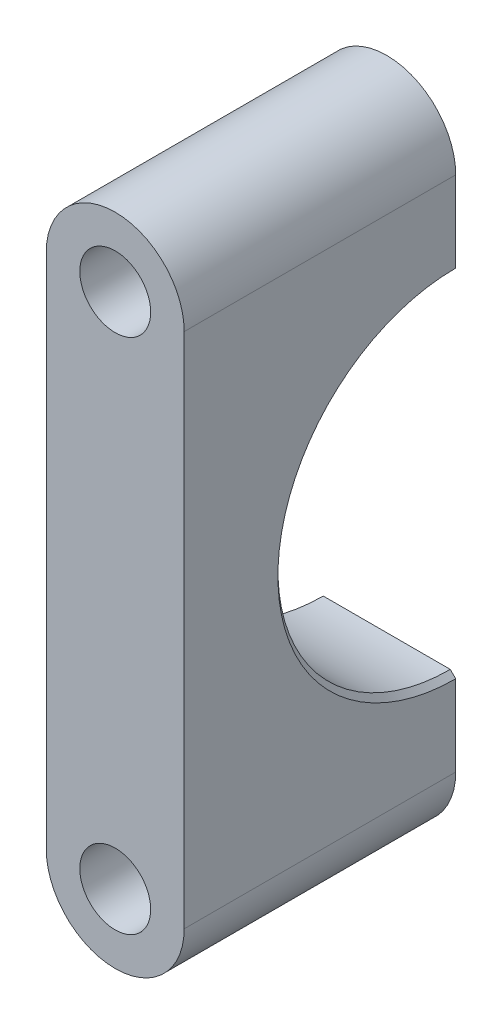
ISO-10303-21;
HEADER;
FILE_DESCRIPTION(('STEP AP214'),'2;1');
FILE_NAME('part.step','',(''),(''),'','','');
FILE_SCHEMA(('AUTOMOTIVE_DESIGN { 1 0 10303 214 1 1 1 1 }'));
ENDSEC;
DATA;
#1=APPLICATION_CONTEXT('core data for automotive mechanical design processes');
#2=APPLICATION_PROTOCOL_DEFINITION('international standard','automotive_design',2000,#1);
#3=PRODUCT_CONTEXT('',#1,'mechanical');
#4=PRODUCT('Part','Part','',(#3));
#5=PRODUCT_RELATED_PRODUCT_CATEGORY('part','',(#4));
#6=PRODUCT_DEFINITION_FORMATION('','',#4);
#7=PRODUCT_DEFINITION_CONTEXT('part definition',#1,'design');
#8=PRODUCT_DEFINITION('design','',#6,#7);
#9=PRODUCT_DEFINITION_SHAPE('','',#8);
#10=(LENGTH_UNIT() NAMED_UNIT(*) SI_UNIT(.MILLI.,.METRE.));
#11=(NAMED_UNIT(*) PLANE_ANGLE_UNIT() SI_UNIT($,.RADIAN.));
#12=(NAMED_UNIT(*) SI_UNIT($,.STERADIAN.) SOLID_ANGLE_UNIT());
#13=UNCERTAINTY_MEASURE_WITH_UNIT(LENGTH_MEASURE(1.E-05),#10,'distance_accuracy_value','');
#14=(GEOMETRIC_REPRESENTATION_CONTEXT(3) GLOBAL_UNCERTAINTY_ASSIGNED_CONTEXT((#13)) GLOBAL_UNIT_ASSIGNED_CONTEXT((#10,
#11,#12)) REPRESENTATION_CONTEXT('',''));
#15=CARTESIAN_POINT('',(0.,0.,0.));
#16=DIRECTION('',(0.,0.,1.));
#17=DIRECTION('',(1.,0.,0.));
#18=AXIS2_PLACEMENT_3D('',#15,#16,#17);
#19=CARTESIAN_POINT('',(0.,-23.8114,0.));
#20=DIRECTION('',(0.,0.,1.));
#21=DIRECTION('',(1.,0.,0.));
#22=AXIS2_PLACEMENT_3D('',#19,#20,#21);
#23=PLANE('',#22);
#24=CARTESIAN_POINT('',(0.,-23.8114,0.));
#25=DIRECTION('',(0.,0.,1.));
#26=DIRECTION('',(1.,0.,0.));
#27=AXIS2_PLACEMENT_3D('',#24,#25,#26);
#28=CIRCLE('',#27,3.2639);
#29=CARTESIAN_POINT('',(3.2639,-23.8114,0.));
#30=VERTEX_POINT('',#29);
#31=EDGE_CURVE('E228',#30,#30,#28,.T.);
#32=ORIENTED_EDGE('',*,*,#31,.T.);
#33=EDGE_LOOP('',(#32));
#34=FACE_BOUND('',#33,.T.);
#35=DIRECTION('',(0.,-1.,0.));
#36=VECTOR('',#35,1.);
#37=CARTESIAN_POINT('',(-6.35,23.8125,0.));
#38=LINE('',#37,#36);
#39=CARTESIAN_POINT('',(-6.35,-16.375,0.));
#40=VERTEX_POINT('',#39);
#41=CARTESIAN_POINT('',(-6.35,-23.8114,0.));
#42=VERTEX_POINT('',#41);
#43=EDGE_CURVE('E147',#40,#42,#38,.T.);
#44=ORIENTED_EDGE('',*,*,#43,.F.);
#45=DIRECTION('',(0.707106781186552,0.707106781186543,0.));
#46=VECTOR('',#45,1.);
#47=CARTESIAN_POINT('',(10.0250000000002,0.,0.));
#48=LINE('',#47,#46);
#49=CARTESIAN_POINT('',(-5.84999999999999,-15.875,0.));
#50=VERTEX_POINT('',#49);
#51=EDGE_CURVE('E57',#40,#50,#48,.T.);
#52=ORIENTED_EDGE('',*,*,#51,.T.);
#53=DIRECTION('',(1.,0.,0.));
#54=VECTOR('',#53,1.);
#55=CARTESIAN_POINT('',(-6.35,-15.875,0.));
#56=LINE('',#55,#54);
#57=CARTESIAN_POINT('',(5.85,-15.875,0.));
#58=VERTEX_POINT('',#57);
#59=EDGE_CURVE('E217',#50,#58,#56,.T.);
#60=ORIENTED_EDGE('',*,*,#59,.T.);
#61=DIRECTION('',(0.707106781186552,-0.707106781186543,0.));
#62=VECTOR('',#61,1.);
#63=CARTESIAN_POINT('',(-10.0250000000002,0.,0.));
#64=LINE('',#63,#62);
#65=CARTESIAN_POINT('',(6.35,-16.375,0.));
#66=VERTEX_POINT('',#65);
#67=EDGE_CURVE('E129',#58,#66,#64,.T.);
#68=ORIENTED_EDGE('',*,*,#67,.T.);
#69=DIRECTION('',(0.,1.,0.));
#70=VECTOR('',#69,1.);
#71=CARTESIAN_POINT('',(6.35,23.8125,0.));
#72=LINE('',#71,#70);
#73=CARTESIAN_POINT('',(6.35,-23.8114,0.));
#74=VERTEX_POINT('',#73);
#75=EDGE_CURVE('E154',#74,#66,#72,.T.);
#76=ORIENTED_EDGE('',*,*,#75,.F.);
#77=CARTESIAN_POINT('',(0.,-23.8114,0.));
#78=DIRECTION('',(0.,0.,1.));
#79=DIRECTION('',(1.,0.,0.));
#80=AXIS2_PLACEMENT_3D('',#77,#78,#79);
#81=CIRCLE('',#80,6.35);
#82=EDGE_CURVE('E125',#42,#74,#81,.T.);
#83=ORIENTED_EDGE('',*,*,#82,.F.);
#84=EDGE_LOOP('',(#44,#52,#60,#68,#76,#83));
#85=FACE_BOUND('',#84,.T.);
#86=ADVANCED_FACE('F35',(#34,#85),#23,.F.);
#87=CARTESIAN_POINT('',(0.,-23.8114,25.0031));
#88=DIRECTION('',(0.,0.,1.));
#89=DIRECTION('',(1.,0.,0.));
#90=AXIS2_PLACEMENT_3D('',#87,#88,#89);
#91=PLANE('',#90);
#92=CARTESIAN_POINT('',(0.,-23.8114,25.0031));
#93=DIRECTION('',(0.,0.,1.));
#94=DIRECTION('',(1.,0.,0.));
#95=AXIS2_PLACEMENT_3D('',#92,#93,#94);
#96=CIRCLE('',#95,3.2639);
#97=CARTESIAN_POINT('',(3.2639,-23.8114,25.0031));
#98=VERTEX_POINT('',#97);
#99=EDGE_CURVE('E230',#98,#98,#96,.T.);
#100=ORIENTED_EDGE('',*,*,#99,.F.);
#101=EDGE_LOOP('',(#100));
#102=FACE_BOUND('',#101,.T.);
#103=CARTESIAN_POINT('',(0.,-23.8114,25.0031));
#104=DIRECTION('',(0.,0.,1.));
#105=DIRECTION('',(1.,0.,0.));
#106=AXIS2_PLACEMENT_3D('',#103,#104,#105);
#107=CIRCLE('',#106,6.35);
#108=CARTESIAN_POINT('',(-6.35,-23.8114,25.0031));
#109=VERTEX_POINT('',#108);
#110=CARTESIAN_POINT('',(6.35,-23.8114,25.0031));
#111=VERTEX_POINT('',#110);
#112=EDGE_CURVE('E111',#109,#111,#107,.T.);
#113=ORIENTED_EDGE('',*,*,#112,.T.);
#114=DIRECTION('',(0.,1.,0.));
#115=VECTOR('',#114,1.);
#116=CARTESIAN_POINT('',(6.35,23.8125,25.0031));
#117=LINE('',#116,#115);
#118=CARTESIAN_POINT('',(6.35,23.8125,25.0031));
#119=VERTEX_POINT('',#118);
#120=EDGE_CURVE('E99',#111,#119,#117,.T.);
#121=ORIENTED_EDGE('',*,*,#120,.T.);
#122=CARTESIAN_POINT('',(0.,23.8125,25.0031));
#123=DIRECTION('',(0.,0.,1.));
#124=DIRECTION('',(1.,0.,0.));
#125=AXIS2_PLACEMENT_3D('',#122,#123,#124);
#126=CIRCLE('',#125,6.35);
#127=CARTESIAN_POINT('',(-6.35,23.8125,25.0031));
#128=VERTEX_POINT('',#127);
#129=EDGE_CURVE('E110',#119,#128,#126,.T.);
#130=ORIENTED_EDGE('',*,*,#129,.T.);
#131=DIRECTION('',(0.,-1.,0.));
#132=VECTOR('',#131,1.);
#133=CARTESIAN_POINT('',(-6.35,23.8125,25.0031));
#134=LINE('',#133,#132);
#135=EDGE_CURVE('E117',#128,#109,#134,.T.);
#136=ORIENTED_EDGE('',*,*,#135,.T.);
#137=EDGE_LOOP('',(#113,#121,#130,#136));
#138=FACE_BOUND('',#137,.T.);
#139=CARTESIAN_POINT('',(0.,23.8125,25.0031));
#140=DIRECTION('',(0.,0.,1.));
#141=DIRECTION('',(1.,0.,0.));
#142=AXIS2_PLACEMENT_3D('',#139,#140,#141);
#143=CIRCLE('',#142,3.2639);
#144=CARTESIAN_POINT('',(3.2639,23.8125,25.0031));
#145=VERTEX_POINT('',#144);
#146=EDGE_CURVE('E223',#145,#145,#143,.T.);
#147=ORIENTED_EDGE('',*,*,#146,.F.);
#148=EDGE_LOOP('',(#147));
#149=FACE_BOUND('',#148,.T.);
#150=ADVANCED_FACE('F114',(#102,#138,#149),#91,.T.);
#151=DIRECTION('',(1.,0.,0.));
#152=VECTOR('',#151,1.);
#153=CARTESIAN_POINT('',(-6.35000000000001,15.875,0.));
#154=LINE('',#153,#152);
#155=CARTESIAN_POINT('',(5.85,15.875,0.));
#156=VERTEX_POINT('',#155);
#157=CARTESIAN_POINT('',(-5.85,15.875,0.));
#158=VERTEX_POINT('',#157);
#159=EDGE_CURVE('E166',#156,#158,#154,.F.);
#160=ORIENTED_EDGE('',*,*,#159,.T.);
#161=DIRECTION('',(-0.707106781186553,0.707106781186542,0.));
#162=VECTOR('',#161,1.);
#163=CARTESIAN_POINT('',(10.0250000000002,0.,0.));
#164=LINE('',#163,#162);
#165=CARTESIAN_POINT('',(-6.35,16.375,0.));
#166=VERTEX_POINT('',#165);
#167=EDGE_CURVE('E11',#158,#166,#164,.T.);
#168=ORIENTED_EDGE('',*,*,#167,.T.);
#169=CARTESIAN_POINT('',(-6.35,23.8125,0.));
#170=VERTEX_POINT('',#169);
#171=EDGE_CURVE('E121',#170,#166,#38,.T.);
#172=ORIENTED_EDGE('',*,*,#171,.F.);
#173=CARTESIAN_POINT('',(0.,23.8125,0.));
#174=DIRECTION('',(0.,0.,1.));
#175=DIRECTION('',(1.,0.,0.));
#176=AXIS2_PLACEMENT_3D('',#173,#174,#175);
#177=CIRCLE('',#176,6.35);
#178=CARTESIAN_POINT('',(6.35,23.8125,0.));
#179=VERTEX_POINT('',#178);
#180=EDGE_CURVE('E152',#179,#170,#177,.T.);
#181=ORIENTED_EDGE('',*,*,#180,.F.);
#182=CARTESIAN_POINT('',(6.35,16.375,0.));
#183=VERTEX_POINT('',#182);
#184=EDGE_CURVE('E235',#183,#179,#72,.T.);
#185=ORIENTED_EDGE('',*,*,#184,.F.);
#186=DIRECTION('',(-0.707106781186552,-0.707106781186543,0.));
#187=VECTOR('',#186,1.);
#188=CARTESIAN_POINT('',(-10.0250000000002,0.,0.));
#189=LINE('',#188,#187);
#190=EDGE_CURVE('E138',#183,#156,#189,.T.);
#191=ORIENTED_EDGE('',*,*,#190,.T.);
#192=EDGE_LOOP('',(#160,#168,#172,#181,#185,#191));
#193=FACE_BOUND('',#192,.T.);
#194=CARTESIAN_POINT('',(0.,23.8125,0.));
#195=DIRECTION('',(0.,0.,1.));
#196=DIRECTION('',(1.,0.,0.));
#197=AXIS2_PLACEMENT_3D('',#194,#195,#196);
#198=CIRCLE('',#197,3.2639);
#199=CARTESIAN_POINT('',(3.2639,23.8125,0.));
#200=VERTEX_POINT('',#199);
#201=EDGE_CURVE('E220',#200,#200,#198,.T.);
#202=ORIENTED_EDGE('',*,*,#201,.T.);
#203=EDGE_LOOP('',(#202));
#204=FACE_BOUND('',#203,.T.);
#205=ADVANCED_FACE('F163',(#193,#204),#23,.F.);
#206=CARTESIAN_POINT('',(0.,-23.8114,25.0031));
#207=DIRECTION('',(0.,0.,-1.));
#208=DIRECTION('',(-1.,0.,0.));
#209=AXIS2_PLACEMENT_3D('',#206,#207,#208);
#210=CYLINDRICAL_SURFACE('',#209,6.35);
#211=ORIENTED_EDGE('',*,*,#82,.T.);
#212=DIRECTION('',(0.,0.,-1.));
#213=VECTOR('',#212,1.);
#214=CARTESIAN_POINT('',(6.35,-23.8114,25.0031));
#215=LINE('',#214,#213);
#216=EDGE_CURVE('E104',#111,#74,#215,.T.);
#217=ORIENTED_EDGE('',*,*,#216,.F.);
#218=ORIENTED_EDGE('',*,*,#112,.F.);
#219=DIRECTION('',(0.,0.,-1.));
#220=VECTOR('',#219,1.);
#221=CARTESIAN_POINT('',(-6.35,-23.8114,25.0031));
#222=LINE('',#221,#220);
#223=EDGE_CURVE('E158',#109,#42,#222,.T.);
#224=ORIENTED_EDGE('',*,*,#223,.T.);
#225=EDGE_LOOP('',(#211,#217,#218,#224));
#226=FACE_BOUND('',#225,.T.);
#227=ADVANCED_FACE('F123',(#226),#210,.T.);
#228=CARTESIAN_POINT('',(6.35,23.8125,25.0031));
#229=DIRECTION('',(-1.,0.,0.));
#230=DIRECTION('',(0.,-1.,0.));
#231=AXIS2_PLACEMENT_3D('',#228,#229,#230);
#232=PLANE('',#231);
#233=ORIENTED_EDGE('',*,*,#75,.T.);
#234=CARTESIAN_POINT('',(6.35,0.,0.));
#235=DIRECTION('',(-1.,0.,0.));
#236=DIRECTION('',(0.,-1.,0.));
#237=AXIS2_PLACEMENT_3D('',#234,#235,#236);
#238=CIRCLE('',#237,16.375);
#239=EDGE_CURVE('E136',#66,#183,#238,.T.);
#240=ORIENTED_EDGE('',*,*,#239,.T.);
#241=ORIENTED_EDGE('',*,*,#184,.T.);
#242=DIRECTION('',(0.,0.,-1.));
#243=VECTOR('',#242,1.);
#244=CARTESIAN_POINT('',(6.35,23.8125,25.0031));
#245=LINE('',#244,#243);
#246=EDGE_CURVE('E107',#119,#179,#245,.T.);
#247=ORIENTED_EDGE('',*,*,#246,.F.);
#248=ORIENTED_EDGE('',*,*,#120,.F.);
#249=ORIENTED_EDGE('',*,*,#216,.T.);
#250=EDGE_LOOP('',(#233,#240,#241,#247,#248,#249));
#251=FACE_BOUND('',#250,.T.);
#252=ADVANCED_FACE('F102',(#251),#232,.F.);
#253=CARTESIAN_POINT('',(0.,23.8125,25.0031));
#254=DIRECTION('',(0.,0.,-1.));
#255=DIRECTION('',(-1.,0.,0.));
#256=AXIS2_PLACEMENT_3D('',#253,#254,#255);
#257=CYLINDRICAL_SURFACE('',#256,6.35);
#258=ORIENTED_EDGE('',*,*,#180,.T.);
#259=DIRECTION('',(0.,0.,-1.));
#260=VECTOR('',#259,1.);
#261=CARTESIAN_POINT('',(-6.35,23.8125,25.0031));
#262=LINE('',#261,#260);
#263=EDGE_CURVE('E131',#128,#170,#262,.T.);
#264=ORIENTED_EDGE('',*,*,#263,.F.);
#265=ORIENTED_EDGE('',*,*,#129,.F.);
#266=ORIENTED_EDGE('',*,*,#246,.T.);
#267=EDGE_LOOP('',(#258,#264,#265,#266));
#268=FACE_BOUND('',#267,.T.);
#269=ADVANCED_FACE('F195',(#268),#257,.T.);
#270=CARTESIAN_POINT('',(-6.35,23.8125,25.0031));
#271=DIRECTION('',(1.,0.,0.));
#272=DIRECTION('',(0.,1.,0.));
#273=AXIS2_PLACEMENT_3D('',#270,#271,#272);
#274=PLANE('',#273);
#275=ORIENTED_EDGE('',*,*,#171,.T.);
#276=CARTESIAN_POINT('',(-6.35,0.,0.));
#277=DIRECTION('',(1.,0.,0.));
#278=DIRECTION('',(0.,1.,0.));
#279=AXIS2_PLACEMENT_3D('',#276,#277,#278);
#280=CIRCLE('',#279,16.375);
#281=EDGE_CURVE('E140',#166,#40,#280,.T.);
#282=ORIENTED_EDGE('',*,*,#281,.T.);
#283=ORIENTED_EDGE('',*,*,#43,.T.);
#284=ORIENTED_EDGE('',*,*,#223,.F.);
#285=ORIENTED_EDGE('',*,*,#135,.F.);
#286=ORIENTED_EDGE('',*,*,#263,.T.);
#287=EDGE_LOOP('',(#275,#282,#283,#284,#285,#286));
#288=FACE_BOUND('',#287,.T.);
#289=ADVANCED_FACE('F146',(#288),#274,.F.);
#290=CARTESIAN_POINT('',(0.,-23.8114,25.0031));
#291=DIRECTION('',(0.,0.,-1.));
#292=DIRECTION('',(-1.,0.,0.));
#293=AXIS2_PLACEMENT_3D('',#290,#291,#292);
#294=CYLINDRICAL_SURFACE('',#293,3.2639);
#295=ORIENTED_EDGE('',*,*,#99,.T.);
#296=EDGE_LOOP('',(#295));
#297=FACE_BOUND('',#296,.T.);
#298=ORIENTED_EDGE('',*,*,#31,.F.);
#299=EDGE_LOOP('',(#298));
#300=FACE_BOUND('',#299,.T.);
#301=ADVANCED_FACE('F199',(#297,#300),#294,.F.);
#302=CARTESIAN_POINT('',(0.,23.8125,25.0031));
#303=DIRECTION('',(0.,0.,-1.));
#304=DIRECTION('',(-1.,0.,0.));
#305=AXIS2_PLACEMENT_3D('',#302,#303,#304);
#306=CYLINDRICAL_SURFACE('',#305,3.2639);
#307=ORIENTED_EDGE('',*,*,#146,.T.);
#308=EDGE_LOOP('',(#307));
#309=FACE_BOUND('',#308,.T.);
#310=ORIENTED_EDGE('',*,*,#201,.F.);
#311=EDGE_LOOP('',(#310));
#312=FACE_BOUND('',#311,.T.);
#313=ADVANCED_FACE('F204',(#309,#312),#306,.F.);
#314=CARTESIAN_POINT('',(-6.35000000000001,0.,0.));
#315=DIRECTION('',(1.,0.,0.));
#316=DIRECTION('',(0.,1.,0.));
#317=AXIS2_PLACEMENT_3D('',#314,#315,#316);
#318=CYLINDRICAL_SURFACE('',#317,15.875);
#319=ORIENTED_EDGE('',*,*,#59,.F.);
#320=CARTESIAN_POINT('',(-5.84999999999999,0.,0.));
#321=DIRECTION('',(1.,0.,0.));
#322=DIRECTION('',(0.,1.,0.));
#323=AXIS2_PLACEMENT_3D('',#320,#321,#322);
#324=CIRCLE('',#323,15.875);
#325=EDGE_CURVE('E43',#50,#158,#324,.F.);
#326=ORIENTED_EDGE('',*,*,#325,.T.);
#327=ORIENTED_EDGE('',*,*,#159,.F.);
#328=CARTESIAN_POINT('',(5.85,0.,0.));
#329=DIRECTION('',(-1.,0.,0.));
#330=DIRECTION('',(0.,-1.,0.));
#331=AXIS2_PLACEMENT_3D('',#328,#329,#330);
#332=CIRCLE('',#331,15.875);
#333=EDGE_CURVE('E126',#156,#58,#332,.F.);
#334=ORIENTED_EDGE('',*,*,#333,.T.);
#335=EDGE_LOOP('',(#319,#326,#327,#334));
#336=FACE_BOUND('',#335,.T.);
#337=ADVANCED_FACE('F172',(#336),#318,.F.);
#338=CARTESIAN_POINT('',(5.85,0.,0.));
#339=DIRECTION('',(1.,0.,0.));
#340=DIRECTION('',(0.,1.,0.));
#341=AXIS2_PLACEMENT_3D('',#338,#339,#340);
#342=CONICAL_SURFACE('',#341,15.875,0.785398163397441);
#343=ORIENTED_EDGE('',*,*,#190,.F.);
#344=ORIENTED_EDGE('',*,*,#239,.F.);
#345=ORIENTED_EDGE('',*,*,#67,.F.);
#346=ORIENTED_EDGE('',*,*,#333,.F.);
#347=EDGE_LOOP('',(#343,#344,#345,#346));
#348=FACE_BOUND('',#347,.T.);
#349=ADVANCED_FACE('F168',(#348),#342,.F.);
#350=CARTESIAN_POINT('',(-6.35,0.,0.));
#351=DIRECTION('',(-1.,0.,0.));
#352=DIRECTION('',(0.,-1.,0.));
#353=AXIS2_PLACEMENT_3D('',#350,#351,#352);
#354=CONICAL_SURFACE('',#353,16.375,0.785398163397441);
#355=ORIENTED_EDGE('',*,*,#167,.F.);
#356=ORIENTED_EDGE('',*,*,#325,.F.);
#357=ORIENTED_EDGE('',*,*,#51,.F.);
#358=ORIENTED_EDGE('',*,*,#281,.F.);
#359=EDGE_LOOP('',(#355,#356,#357,#358));
#360=FACE_BOUND('',#359,.T.);
#361=ADVANCED_FACE('F37',(#360),#354,.F.);
#362=CLOSED_SHELL('',(#86,#150,#205,#227,#252,#269,#289,#301,#313,#337,#349,#361));
#363=MANIFOLD_SOLID_BREP('B2',#362);
#364=ADVANCED_BREP_SHAPE_REPRESENTATION('',(#18,#363),#14);
#365=SHAPE_DEFINITION_REPRESENTATION(#9,#364);
ENDSEC;
END-ISO-10303-21;
